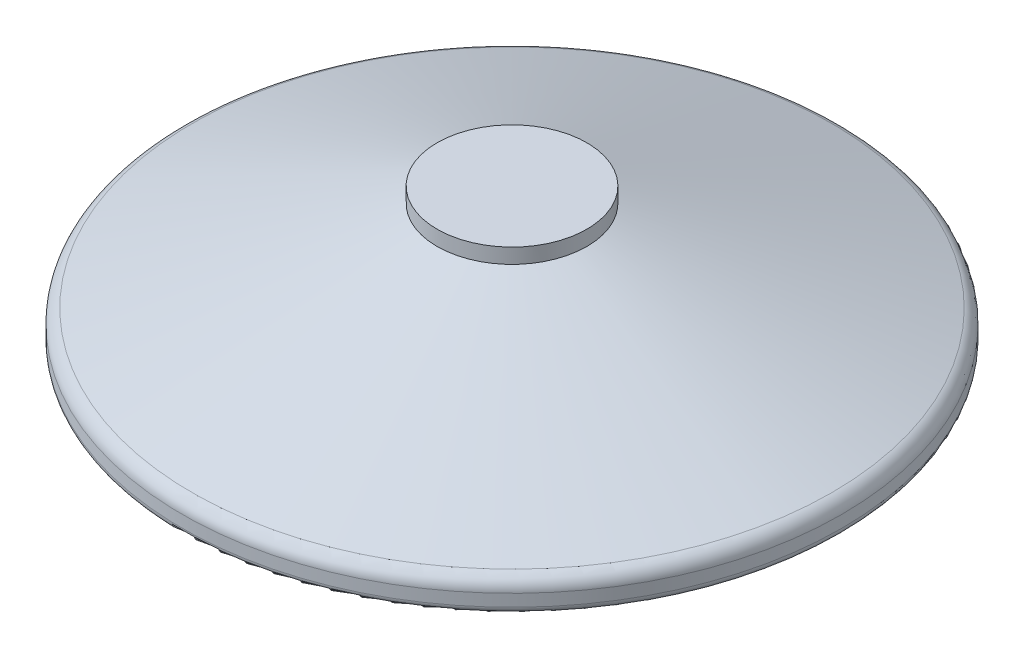
ISO-10303-21;
HEADER;
FILE_DESCRIPTION(('STEP AP214'),'2;1');
FILE_NAME('part.step','',(''),(''),'','','');
FILE_SCHEMA(('AUTOMOTIVE_DESIGN { 1 0 10303 214 1 1 1 1 }'));
ENDSEC;
DATA;
#1=APPLICATION_CONTEXT('core data for automotive mechanical design processes');
#2=APPLICATION_PROTOCOL_DEFINITION('international standard','automotive_design',2000,#1);
#3=PRODUCT_CONTEXT('',#1,'mechanical');
#4=PRODUCT('Part','Part','',(#3));
#5=PRODUCT_RELATED_PRODUCT_CATEGORY('part','',(#4));
#6=PRODUCT_DEFINITION_FORMATION('','',#4);
#7=PRODUCT_DEFINITION_CONTEXT('part definition',#1,'design');
#8=PRODUCT_DEFINITION('design','',#6,#7);
#9=PRODUCT_DEFINITION_SHAPE('','',#8);
#10=(LENGTH_UNIT() NAMED_UNIT(*) SI_UNIT(.MILLI.,.METRE.));
#11=(NAMED_UNIT(*) PLANE_ANGLE_UNIT() SI_UNIT($,.RADIAN.));
#12=(NAMED_UNIT(*) SI_UNIT($,.STERADIAN.) SOLID_ANGLE_UNIT());
#13=UNCERTAINTY_MEASURE_WITH_UNIT(LENGTH_MEASURE(1.E-05),#10,'distance_accuracy_value','');
#14=(GEOMETRIC_REPRESENTATION_CONTEXT(3) GLOBAL_UNCERTAINTY_ASSIGNED_CONTEXT((#13)) GLOBAL_UNIT_ASSIGNED_CONTEXT((#10,
#11,#12)) REPRESENTATION_CONTEXT('',''));
#15=CARTESIAN_POINT('',(0.,0.,0.));
#16=DIRECTION('',(0.,0.,1.));
#17=DIRECTION('',(1.,0.,0.));
#18=AXIS2_PLACEMENT_3D('',#15,#16,#17);
#19=CARTESIAN_POINT('',(0.,57.0535714285716,0.));
#20=DIRECTION('',(0.,1.,0.));
#21=DIRECTION('',(-1.,0.,0.));
#22=AXIS2_PLACEMENT_3D('',#19,#20,#21);
#23=CYLINDRICAL_SURFACE('',#22,22.);
#24=CARTESIAN_POINT('',(0.,0.5,0.));
#25=DIRECTION('',(0.,-1.,0.));
#26=DIRECTION('',(1.,0.,0.));
#27=AXIS2_PLACEMENT_3D('',#24,#25,#26);
#28=CIRCLE('',#27,22.);
#29=CARTESIAN_POINT('',(22.,0.500000000000003,0.));
#30=VERTEX_POINT('',#29);
#31=EDGE_CURVE('E10',#30,#30,#28,.F.);
#32=ORIENTED_EDGE('',*,*,#31,.T.);
#33=EDGE_LOOP('',(#32));
#34=FACE_BOUND('',#33,.T.);
#35=CARTESIAN_POINT('',(0.,1.30412884078423,0.));
#36=DIRECTION('',(0.,-1.,0.));
#37=DIRECTION('',(1.,0.,0.));
#38=AXIS2_PLACEMENT_3D('',#35,#36,#37);
#39=CIRCLE('',#38,22.);
#40=CARTESIAN_POINT('',(22.,1.30412884078423,0.));
#41=VERTEX_POINT('',#40);
#42=EDGE_CURVE('E41',#41,#41,#39,.T.);
#43=ORIENTED_EDGE('',*,*,#42,.T.);
#44=EDGE_LOOP('',(#43));
#45=FACE_BOUND('',#44,.T.);
#46=ADVANCED_FACE('F34',(#34,#45),#23,.T.);
#47=CARTESIAN_POINT('',(0.,8.3,0.));
#48=DIRECTION('',(0.,-1.,0.));
#49=DIRECTION('',(1.,0.,0.));
#50=AXIS2_PLACEMENT_3D('',#47,#48,#49);
#51=CONICAL_SURFACE('',#50,5.,1.21589910390507);
#52=CARTESIAN_POINT('',(0.,2.24181104898453,0.));
#53=DIRECTION('',(0.,1.,0.));
#54=DIRECTION('',(-1.,0.,0.));
#55=AXIS2_PLACEMENT_3D('',#52,#53,#54);
#56=CIRCLE('',#55,21.3474939948036);
#57=CARTESIAN_POINT('',(21.3474939948037,2.24181104898454,0.));
#58=VERTEX_POINT('',#57);
#59=EDGE_CURVE('E45',#58,#58,#56,.T.);
#60=CARTESIAN_POINT('',(0.,8.3,0.));
#61=DIRECTION('',(0.,1.,0.));
#62=DIRECTION('',(-1.,0.,0.));
#63=AXIS2_PLACEMENT_3D('',#60,#61,#62);
#64=CIRCLE('',#63,5.);
#65=CARTESIAN_POINT('',(5.,8.3,0.));
#66=VERTEX_POINT('',#65);
#67=EDGE_CURVE('E49',#66,#66,#64,.T.);
#68=CARTESIAN_POINT('',(21.3474939948037,2.24181104898454,0.));
#69=CARTESIAN_POINT('',(21.1772075990244,2.30491718389095,0.));
#70=CARTESIAN_POINT('',(21.0069212032452,2.36802331879736,0.));
#71=CARTESIAN_POINT('',(20.6663484116868,2.49423558861018,0.));
#72=CARTESIAN_POINT('',(20.4960620159076,2.55734172351659,0.));
#73=CARTESIAN_POINT('',(20.1554892243492,2.68355399332941,0.));
#74=CARTESIAN_POINT('',(19.98520282857,2.74666012823582,0.));
#75=CARTESIAN_POINT('',(19.6446300370116,2.87287239804865,0.));
#76=CARTESIAN_POINT('',(19.4743436412324,2.93597853295506,0.));
#77=CARTESIAN_POINT('',(19.133770849674,3.06219080276788,0.));
#78=CARTESIAN_POINT('',(18.9634844538948,3.12529693767429,0.));
#79=CARTESIAN_POINT('',(18.6229116623364,3.25150920748711,0.));
#80=CARTESIAN_POINT('',(18.4526252665572,3.31461534239352,0.));
#81=CARTESIAN_POINT('',(18.1120524749988,3.44082761220635,0.));
#82=CARTESIAN_POINT('',(17.9417660792196,3.50393374711276,0.));
#83=CARTESIAN_POINT('',(17.6011932876612,3.63014601692558,0.));
#84=CARTESIAN_POINT('',(17.4309068918819,3.69325215183199,0.));
#85=CARTESIAN_POINT('',(17.0903341003235,3.81946442164481,0.));
#86=CARTESIAN_POINT('',(16.9200477045443,3.88257055655122,0.));
#87=CARTESIAN_POINT('',(16.5794749129859,4.00878282636405,0.));
#88=CARTESIAN_POINT('',(16.4091885172067,4.07188896127046,0.));
#89=CARTESIAN_POINT('',(16.0686157256483,4.19810123108328,0.));
#90=CARTESIAN_POINT('',(15.8983293298691,4.26120736598969,0.));
#91=CARTESIAN_POINT('',(15.5577565383107,4.38741963580251,0.));
#92=CARTESIAN_POINT('',(15.3874701425315,4.45052577070892,0.));
#93=CARTESIAN_POINT('',(15.0468973509731,4.57673804052175,0.));
#94=CARTESIAN_POINT('',(14.8766109551939,4.63984417542816,0.));
#95=CARTESIAN_POINT('',(14.5360381636355,4.76605644524098,0.));
#96=CARTESIAN_POINT('',(14.3657517678563,4.82916258014739,0.));
#97=CARTESIAN_POINT('',(14.0251789762978,4.95537484996021,0.));
#98=CARTESIAN_POINT('',(13.8548925805186,5.01848098486662,0.));
#99=CARTESIAN_POINT('',(13.5143197889602,5.14469325467945,0.));
#100=CARTESIAN_POINT('',(13.344033393181,5.20779938958586,0.));
#101=CARTESIAN_POINT('',(13.0034606016226,5.33401165939868,0.));
#102=CARTESIAN_POINT('',(12.8331742058434,5.39711779430509,0.));
#103=CARTESIAN_POINT('',(12.492601414285,5.52333006411791,0.));
#104=CARTESIAN_POINT('',(12.3223150185058,5.58643619902432,0.));
#105=CARTESIAN_POINT('',(11.9817422269474,5.71264846883715,0.));
#106=CARTESIAN_POINT('',(11.8114558311682,5.77575460374356,0.));
#107=CARTESIAN_POINT('',(11.4708830396098,5.90196687355638,0.));
#108=CARTESIAN_POINT('',(11.3005966438306,5.96507300846279,0.));
#109=CARTESIAN_POINT('',(10.9600238522722,6.09128527827561,0.));
#110=CARTESIAN_POINT('',(10.789737456493,6.15439141318203,0.));
#111=CARTESIAN_POINT('',(10.4491646649346,6.28060368299485,0.));
#112=CARTESIAN_POINT('',(10.2788782691553,6.34370981790126,0.));
#113=CARTESIAN_POINT('',(9.93830547759694,6.46992208771408,0.));
#114=CARTESIAN_POINT('',(9.76801908181773,6.53302822262049,0.));
#115=CARTESIAN_POINT('',(9.42744629025932,6.65924049243332,0.));
#116=CARTESIAN_POINT('',(9.25715989448012,6.72234662733973,0.));
#117=CARTESIAN_POINT('',(8.91658710292171,6.84855889715255,0.));
#118=CARTESIAN_POINT('',(8.74630070714251,6.91166503205896,0.));
#119=CARTESIAN_POINT('',(8.4057279155841,7.03787730187178,0.));
#120=CARTESIAN_POINT('',(8.23544151980489,7.10098343677819,0.));
#121=CARTESIAN_POINT('',(7.89486872824649,7.22719570659101,0.));
#122=CARTESIAN_POINT('',(7.72458233246728,7.29030184149743,0.));
#123=CARTESIAN_POINT('',(7.38400954090887,7.41651411131025,0.));
#124=CARTESIAN_POINT('',(7.21372314512966,7.47962024621666,0.));
#125=CARTESIAN_POINT('',(6.87315035357125,7.60583251602948,0.));
#126=CARTESIAN_POINT('',(6.70286395779205,7.66893865093589,0.));
#127=CARTESIAN_POINT('',(6.36229116623364,7.79515092074871,0.));
#128=CARTESIAN_POINT('',(6.19200477045444,7.85825705565513,0.));
#129=CARTESIAN_POINT('',(5.85143197889603,7.98446932546795,0.));
#130=CARTESIAN_POINT('',(5.68114558311682,8.04757546037436,0.));
#131=CARTESIAN_POINT('',(5.34057279155841,8.17378773018718,0.));
#132=CARTESIAN_POINT('',(5.17028639577921,8.23689386509359,0.));
#133=CARTESIAN_POINT('',(5.,8.3,0.));
#134=B_SPLINE_CURVE_WITH_KNOTS('',3,(#68,#69,#70,#71,#72,#73,#74,#75,#76,#77,#78,#79,#80,#81,
#82,#83,#84,#85,#86,#87,#88,#89,#90,#91,#92,#93,#94,#95,#96,#97,#98,#99,#100,#101,#102,#103,
#104,#105,#106,#107,#108,#109,#110,#111,#112,#113,#114,#115,#116,#117,#118,#119,#120,#121,#122,
#123,#124,#125,#126,#127,#128,#129,#130,#131,#132,#133),.UNSPECIFIED.,.F.,.F.,(4,2,2,2,2,2,2,2,
2,2,2,2,2,2,2,2,2,2,2,2,2,2,2,2,2,2,2,2,2,2,2,2,4),(0.,0.544810579607887,1.08962115921577,
1.63443173882366,2.17924231843155,2.72405289803944,3.26886347764733,3.81367405725522,
4.3584846368631,4.90329521647099,5.44810579607888,5.99291637568676,6.53772695529466,
7.08253753490254,7.62734811451043,8.17215869411832,8.71696927372621,9.2617798533341,
9.80659043294198,10.3514010125499,10.8962115921578,11.4410221717656,11.9858327513735,
12.5306433309814,13.0754539105893,13.6202644901972,14.1650750698051,14.709885649413,
15.2546962290209,15.7995068086288,16.3443173882366,16.8891279678445,17.4339385474524),.UNSPECIFIED.);
#135=EDGE_CURVE('BSEAM81',#58,#66,#134,.T.);
#136=ORIENTED_EDGE('',*,*,#59,.T.);
#137=ORIENTED_EDGE('',*,*,#67,.F.);
#138=ORIENTED_EDGE('',*,*,#135,.T.);
#139=ORIENTED_EDGE('',*,*,#135,.F.);
#140=EDGE_LOOP('',(#136,#138,#137,#139));
#141=FACE_BOUND('',#140,.T.);
#142=ADVANCED_FACE('F81',(#141),#51,.T.);
#143=CARTESIAN_POINT('',(0.,57.0535714285716,0.));
#144=DIRECTION('',(0.,1.,0.));
#145=DIRECTION('',(-1.,0.,0.));
#146=AXIS2_PLACEMENT_3D('',#143,#144,#145);
#147=CYLINDRICAL_SURFACE('',#146,5.);
#148=ORIENTED_EDGE('',*,*,#67,.T.);
#149=EDGE_LOOP('',(#148));
#150=FACE_BOUND('',#149,.T.);
#151=CARTESIAN_POINT('',(0.,9.3,0.));
#152=DIRECTION('',(0.,1.,0.));
#153=DIRECTION('',(-1.,0.,0.));
#154=AXIS2_PLACEMENT_3D('',#151,#152,#153);
#155=CIRCLE('',#154,5.);
#156=CARTESIAN_POINT('',(-4.99999999999999,9.3,0.));
#157=VERTEX_POINT('',#156);
#158=EDGE_CURVE('E54',#157,#157,#155,.T.);
#159=ORIENTED_EDGE('',*,*,#158,.F.);
#160=EDGE_LOOP('',(#159));
#161=FACE_BOUND('',#160,.T.);
#162=ADVANCED_FACE('F86',(#150,#161),#147,.T.);
#163=CARTESIAN_POINT('',(-4.99999999999999,9.3,0.));
#164=DIRECTION('',(0.,1.,0.));
#165=DIRECTION('',(-1.,0.,0.));
#166=AXIS2_PLACEMENT_3D('',#163,#164,#165);
#167=PLANE('',#166);
#168=ORIENTED_EDGE('',*,*,#158,.T.);
#169=EDGE_LOOP('',(#168));
#170=FACE_BOUND('',#169,.T.);
#171=ADVANCED_FACE('F77',(#170),#167,.T.);
#172=CARTESIAN_POINT('',(-5.99999999999999,4.15321248268254,0.));
#173=DIRECTION('',(0.,-1.,0.));
#174=DIRECTION('',(1.,0.,0.));
#175=AXIS2_PLACEMENT_3D('',#172,#173,#174);
#176=PLANE('',#175);
#177=CARTESIAN_POINT('',(0.,4.15321248268254,0.));
#178=DIRECTION('',(0.,1.,0.));
#179=DIRECTION('',(-1.,0.,0.));
#180=AXIS2_PLACEMENT_3D('',#177,#178,#179);
#181=CIRCLE('',#180,6.);
#182=CARTESIAN_POINT('',(6.00000000000001,4.15321248268254,0.));
#183=VERTEX_POINT('',#182);
#184=EDGE_CURVE('E57',#183,#183,#181,.T.);
#185=ORIENTED_EDGE('',*,*,#184,.F.);
#186=EDGE_LOOP('',(#185));
#187=FACE_BOUND('',#186,.T.);
#188=ADVANCED_FACE('F69',(#187),#176,.T.);
#189=CARTESIAN_POINT('',(0.,0.,0.));
#190=DIRECTION('',(0.,-1.,0.));
#191=DIRECTION('',(1.,0.,0.));
#192=AXIS2_PLACEMENT_3D('',#189,#190,#191);
#193=CONICAL_SURFACE('',#192,21.5,1.30899693899574);
#194=CARTESIAN_POINT('',(0.,0.,0.));
#195=DIRECTION('',(0.,1.,0.));
#196=DIRECTION('',(-1.,0.,0.));
#197=AXIS2_PLACEMENT_3D('',#194,#195,#196);
#198=CIRCLE('',#197,21.5);
#199=CARTESIAN_POINT('',(21.5,0.,0.));
#200=VERTEX_POINT('',#199);
#201=EDGE_CURVE('E60',#200,#200,#198,.T.);
#202=CARTESIAN_POINT('',(6.00000000000001,4.15321248268254,0.));
#203=CARTESIAN_POINT('',(6.16145833333334,4.10994985265459,0.));
#204=CARTESIAN_POINT('',(6.32291666666668,4.06668722262665,0.));
#205=CARTESIAN_POINT('',(6.64583333333334,3.98016196257076,0.));
#206=CARTESIAN_POINT('',(6.80729166666668,3.93689933254282,0.));
#207=CARTESIAN_POINT('',(7.13020833333334,3.85037407248694,0.));
#208=CARTESIAN_POINT('',(7.29166666666668,3.80711144245899,0.));
#209=CARTESIAN_POINT('',(7.61458333333334,3.72058618240311,0.));
#210=CARTESIAN_POINT('',(7.77604166666668,3.67732355237516,0.));
#211=CARTESIAN_POINT('',(8.09895833333334,3.59079829231928,0.));
#212=CARTESIAN_POINT('',(8.26041666666668,3.54753566229133,0.));
#213=CARTESIAN_POINT('',(8.58333333333334,3.46101040223545,0.));
#214=CARTESIAN_POINT('',(8.74479166666668,3.4177477722075,0.));
#215=CARTESIAN_POINT('',(9.06770833333334,3.33122251215162,0.));
#216=CARTESIAN_POINT('',(9.22916666666668,3.28795988212368,0.));
#217=CARTESIAN_POINT('',(9.55208333333334,3.20143462206779,0.));
#218=CARTESIAN_POINT('',(9.71354166666668,3.15817199203985,0.));
#219=CARTESIAN_POINT('',(10.0364583333333,3.07164673198396,0.));
#220=CARTESIAN_POINT('',(10.1979166666667,3.02838410195602,0.));
#221=CARTESIAN_POINT('',(10.5208333333333,2.94185884190013,0.));
#222=CARTESIAN_POINT('',(10.6822916666667,2.89859621187219,0.));
#223=CARTESIAN_POINT('',(11.0052083333333,2.8120709518163,0.));
#224=CARTESIAN_POINT('',(11.1666666666667,2.76880832178836,0.));
#225=CARTESIAN_POINT('',(11.4895833333333,2.68228306173247,0.));
#226=CARTESIAN_POINT('',(11.6510416666667,2.63902043170453,0.));
#227=CARTESIAN_POINT('',(11.9739583333333,2.55249517164864,0.));
#228=CARTESIAN_POINT('',(12.1354166666667,2.5092325416207,0.));
#229=CARTESIAN_POINT('',(12.4583333333333,2.42270728156481,0.));
#230=CARTESIAN_POINT('',(12.6197916666667,2.37944465153687,0.));
#231=CARTESIAN_POINT('',(12.9427083333333,2.29291939148099,0.));
#232=CARTESIAN_POINT('',(13.1041666666667,2.24965676145304,0.));
#233=CARTESIAN_POINT('',(13.4270833333333,2.16313150139716,0.));
#234=CARTESIAN_POINT('',(13.5885416666667,2.11986887136921,0.));
#235=CARTESIAN_POINT('',(13.9114583333333,2.03334361131333,0.));
#236=CARTESIAN_POINT('',(14.0729166666667,1.99008098128538,0.));
#237=CARTESIAN_POINT('',(14.3958333333333,1.9035557212295,0.));
#238=CARTESIAN_POINT('',(14.5572916666667,1.86029309120155,0.));
#239=CARTESIAN_POINT('',(14.8802083333333,1.77376783114567,0.));
#240=CARTESIAN_POINT('',(15.0416666666667,1.73050520111773,0.));
#241=CARTESIAN_POINT('',(15.3645833333333,1.64397994106184,0.));
#242=CARTESIAN_POINT('',(15.5260416666667,1.6007173110339,0.));
#243=CARTESIAN_POINT('',(15.8489583333333,1.51419205097801,0.));
#244=CARTESIAN_POINT('',(16.0104166666667,1.47092942095007,0.));
#245=CARTESIAN_POINT('',(16.3333333333333,1.38440416089418,0.));
#246=CARTESIAN_POINT('',(16.4947916666667,1.34114153086624,0.));
#247=CARTESIAN_POINT('',(16.8177083333333,1.25461627081035,0.));
#248=CARTESIAN_POINT('',(16.9791666666667,1.21135364078241,0.));
#249=CARTESIAN_POINT('',(17.3020833333333,1.12482838072652,0.));
#250=CARTESIAN_POINT('',(17.4635416666667,1.08156575069858,0.));
#251=CARTESIAN_POINT('',(17.7864583333333,0.995040490642693,0.));
#252=CARTESIAN_POINT('',(17.9479166666667,0.95177786061475,0.));
#253=CARTESIAN_POINT('',(18.2708333333333,0.865252600558864,0.));
#254=CARTESIAN_POINT('',(18.4322916666667,0.821989970530921,0.));
#255=CARTESIAN_POINT('',(18.7552083333333,0.735464710475035,0.));
#256=CARTESIAN_POINT('',(18.9166666666667,0.692202080447092,0.));
#257=CARTESIAN_POINT('',(19.2395833333333,0.605676820391206,0.));
#258=CARTESIAN_POINT('',(19.4010416666667,0.562414190363263,0.));
#259=CARTESIAN_POINT('',(19.7239583333333,0.475888930307377,0.));
#260=CARTESIAN_POINT('',(19.8854166666667,0.432626300279433,0.));
#261=CARTESIAN_POINT('',(20.2083333333333,0.346101040223547,0.));
#262=CARTESIAN_POINT('',(20.3697916666667,0.302838410195604,0.));
#263=CARTESIAN_POINT('',(20.6927083333333,0.216313150139718,0.));
#264=CARTESIAN_POINT('',(20.8541666666667,0.173050520111775,0.));
#265=CARTESIAN_POINT('',(21.1770833333333,0.0865252600558886,0.));
#266=CARTESIAN_POINT('',(21.3385416666667,0.0432626300279457,0.));
#267=CARTESIAN_POINT('',(21.5,0.,0.));
#268=B_SPLINE_CURVE_WITH_KNOTS('',3,(#202,#203,#204,#205,#206,#207,#208,#209,#210,#211,#212,
#213,#214,#215,#216,#217,#218,#219,#220,#221,#222,#223,#224,#225,#226,#227,#228,#229,#230,#231,
#232,#233,#234,#235,#236,#237,#238,#239,#240,#241,#242,#243,#244,#245,#246,#247,#248,#249,#250,
#251,#252,#253,#254,#255,#256,#257,#258,#259,#260,#261,#262,#263,#264,#265,#266,#267),
.UNSPECIFIED.,.F.,.F.,(4,2,2,2,2,2,2,2,2,2,2,2,2,2,2,2,2,2,2,2,2,2,2,2,2,2,2,2,2,2,2,2,4),(0.,
0.501461899886132,1.00292379977227,1.50438569965841,2.00584759954454,2.50730949943068,
3.00877139931681,3.51023329920294,4.01169519908908,4.51315709897521,5.01461899886135,
5.51608089874748,6.01754279863362,6.51900469851975,7.02046659840589,7.52192849829202,
8.02339039817816,8.52485229806429,9.02631419795043,9.52777609783656,10.0292379977227,
10.5306998976088,11.032161797495,11.5336236973811,12.0350855972672,12.5365474971534,
13.0380093970395,13.5394712969256,14.0409331968118,14.5423950966979,15.0438569965841,
15.5453188964702,16.0467807963563),.UNSPECIFIED.);
#269=EDGE_CURVE('BSEAM66',#183,#200,#268,.T.);
#270=ORIENTED_EDGE('',*,*,#184,.T.);
#271=ORIENTED_EDGE('',*,*,#201,.F.);
#272=ORIENTED_EDGE('',*,*,#269,.T.);
#273=ORIENTED_EDGE('',*,*,#269,.F.);
#274=EDGE_LOOP('',(#270,#272,#271,#273));
#275=FACE_BOUND('',#274,.T.);
#276=ADVANCED_FACE('F66',(#275),#193,.F.);
#277=CARTESIAN_POINT('',(0.,1.30412884078423,0.));
#278=DIRECTION('',(0.,-1.,0.));
#279=DIRECTION('',(1.,0.,0.));
#280=AXIS2_PLACEMENT_3D('',#277,#278,#279);
#281=TOROIDAL_SURFACE('',#280,21.,1.);
#282=ORIENTED_EDGE('',*,*,#42,.F.);
#283=EDGE_LOOP('',(#282));
#284=FACE_BOUND('',#283,.T.);
#285=ORIENTED_EDGE('',*,*,#59,.F.);
#286=EDGE_LOOP('',(#285));
#287=FACE_BOUND('',#286,.T.);
#288=ADVANCED_FACE('F68',(#284,#287),#281,.T.);
#289=CARTESIAN_POINT('',(0.,0.5,0.));
#290=DIRECTION('',(0.,-1.,0.));
#291=DIRECTION('',(1.,0.,0.));
#292=AXIS2_PLACEMENT_3D('',#289,#290,#291);
#293=TOROIDAL_SURFACE('',#292,21.5,0.5);
#294=ORIENTED_EDGE('',*,*,#201,.T.);
#295=EDGE_LOOP('',(#294));
#296=FACE_BOUND('',#295,.T.);
#297=ORIENTED_EDGE('',*,*,#31,.F.);
#298=EDGE_LOOP('',(#297));
#299=FACE_BOUND('',#298,.T.);
#300=ADVANCED_FACE('F36',(#296,#299),#293,.T.);
#301=CLOSED_SHELL('',(#46,#142,#162,#171,#188,#276,#288,#300));
#302=MANIFOLD_SOLID_BREP('B2',#301);
#303=ADVANCED_BREP_SHAPE_REPRESENTATION('',(#18,#302),#14);
#304=SHAPE_DEFINITION_REPRESENTATION(#9,#303);
ENDSEC;
END-ISO-10303-21;
